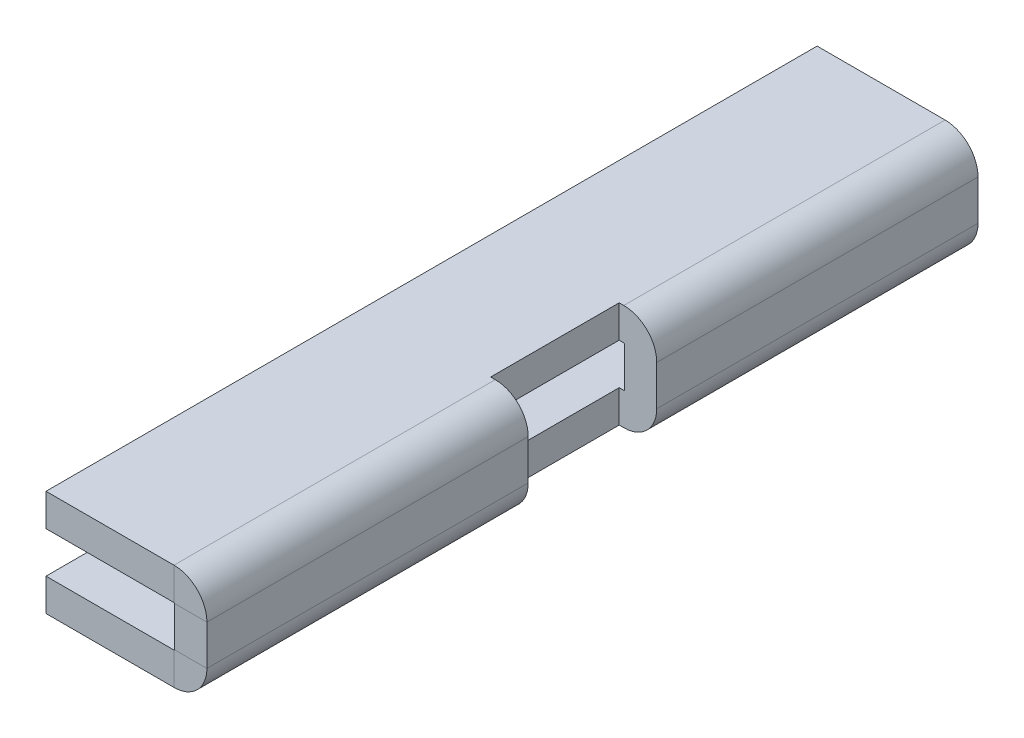
ISO-10303-21;
HEADER;
FILE_DESCRIPTION(('STEP AP214'),'2;1');
FILE_NAME('part.step','',(''),(''),'','','');
FILE_SCHEMA(('AUTOMOTIVE_DESIGN { 1 0 10303 214 1 1 1 1 }'));
ENDSEC;
DATA;
#1=APPLICATION_CONTEXT('core data for automotive mechanical design processes');
#2=APPLICATION_PROTOCOL_DEFINITION('international standard','automotive_design',2000,#1);
#3=PRODUCT_CONTEXT('',#1,'mechanical');
#4=PRODUCT('Part','Part','',(#3));
#5=PRODUCT_RELATED_PRODUCT_CATEGORY('part','',(#4));
#6=PRODUCT_DEFINITION_FORMATION('','',#4);
#7=PRODUCT_DEFINITION_CONTEXT('part definition',#1,'design');
#8=PRODUCT_DEFINITION('design','',#6,#7);
#9=PRODUCT_DEFINITION_SHAPE('','',#8);
#10=(LENGTH_UNIT() NAMED_UNIT(*) SI_UNIT(.MILLI.,.METRE.));
#11=(NAMED_UNIT(*) PLANE_ANGLE_UNIT() SI_UNIT($,.RADIAN.));
#12=(NAMED_UNIT(*) SI_UNIT($,.STERADIAN.) SOLID_ANGLE_UNIT());
#13=UNCERTAINTY_MEASURE_WITH_UNIT(LENGTH_MEASURE(1.E-05),#10,'distance_accuracy_value','');
#14=(GEOMETRIC_REPRESENTATION_CONTEXT(3) GLOBAL_UNCERTAINTY_ASSIGNED_CONTEXT((#13)) GLOBAL_UNIT_ASSIGNED_CONTEXT((#10,
#11,#12)) REPRESENTATION_CONTEXT('',''));
#15=CARTESIAN_POINT('',(0.,0.,0.));
#16=DIRECTION('',(0.,0.,1.));
#17=DIRECTION('',(1.,0.,0.));
#18=AXIS2_PLACEMENT_3D('',#15,#16,#17);
#19=CARTESIAN_POINT('',(0.,1.016,-19.05));
#20=DIRECTION('',(1.,0.,0.));
#21=DIRECTION('',(0.,1.,0.));
#22=AXIS2_PLACEMENT_3D('',#19,#20,#21);
#23=PLANE('',#22);
#24=DIRECTION('',(0.,1.,0.));
#25=VECTOR('',#24,1.);
#26=CARTESIAN_POINT('',(0.,1.016,3.175));
#27=LINE('',#26,#25);
#28=CARTESIAN_POINT('',(0.,-0.990599999999999,3.175));
#29=VERTEX_POINT('',#28);
#30=CARTESIAN_POINT('',(0.,0.9906,3.175));
#31=VERTEX_POINT('',#30);
#32=EDGE_CURVE('E53',#29,#31,#27,.T.);
#33=ORIENTED_EDGE('',*,*,#32,.F.);
#34=DIRECTION('',(0.,0.,1.));
#35=VECTOR('',#34,1.);
#36=CARTESIAN_POINT('',(0.,-0.990599999999999,19.05));
#37=LINE('',#36,#35);
#38=CARTESIAN_POINT('',(0.,-0.990599999999999,19.05));
#39=VERTEX_POINT('',#38);
#40=EDGE_CURVE('E286',#29,#39,#37,.T.);
#41=ORIENTED_EDGE('',*,*,#40,.T.);
#42=DIRECTION('',(0.,1.,0.));
#43=VECTOR('',#42,1.);
#44=CARTESIAN_POINT('',(0.,1.016,19.05));
#45=LINE('',#44,#43);
#46=CARTESIAN_POINT('',(0.,0.9906,19.05));
#47=VERTEX_POINT('',#46);
#48=EDGE_CURVE('E271',#39,#47,#45,.T.);
#49=ORIENTED_EDGE('',*,*,#48,.T.);
#50=DIRECTION('',(0.,0.,1.));
#51=VECTOR('',#50,1.);
#52=CARTESIAN_POINT('',(0.,0.9906,-19.05));
#53=LINE('',#52,#51);
#54=EDGE_CURVE('E305',#47,#31,#53,.F.);
#55=ORIENTED_EDGE('',*,*,#54,.T.);
#56=EDGE_LOOP('',(#33,#41,#49,#55));
#57=FACE_BOUND('',#56,.T.);
#58=ADVANCED_FACE('F38',(#57),#23,.F.);
#59=CARTESIAN_POINT('',(-0.0254000000000003,-0.990599999999999,-19.05));
#60=DIRECTION('',(0.,0.,-1.));
#61=DIRECTION('',(-1.,0.,0.));
#62=AXIS2_PLACEMENT_3D('',#59,#60,#61);
#63=CYLINDRICAL_SURFACE('',#62,0.0254000000000001);
#64=CARTESIAN_POINT('',(-0.0254000000000003,-0.990599999999999,3.175));
#65=DIRECTION('',(0.,0.,-1.));
#66=DIRECTION('',(-1.,0.,0.));
#67=AXIS2_PLACEMENT_3D('',#64,#65,#66);
#68=CIRCLE('',#67,0.0254000000000001);
#69=CARTESIAN_POINT('',(-0.0254000000000003,-1.016,3.175));
#70=VERTEX_POINT('',#69);
#71=EDGE_CURVE('E236',#70,#29,#68,.F.);
#72=ORIENTED_EDGE('',*,*,#71,.F.);
#73=DIRECTION('',(0.,0.,1.));
#74=VECTOR('',#73,1.);
#75=CARTESIAN_POINT('',(-0.0254000000000003,-1.016,-19.05));
#76=LINE('',#75,#74);
#77=CARTESIAN_POINT('',(-0.0254000000000003,-1.016,19.05));
#78=VERTEX_POINT('',#77);
#79=EDGE_CURVE('E291',#78,#70,#76,.F.);
#80=ORIENTED_EDGE('',*,*,#79,.F.);
#81=CARTESIAN_POINT('',(-0.0254000000000003,-0.990599999999999,19.05));
#82=DIRECTION('',(0.,0.,-1.));
#83=DIRECTION('',(-1.,0.,0.));
#84=AXIS2_PLACEMENT_3D('',#81,#82,#83);
#85=CIRCLE('',#84,0.0254000000000001);
#86=EDGE_CURVE('E295',#78,#39,#85,.F.);
#87=ORIENTED_EDGE('',*,*,#86,.T.);
#88=ORIENTED_EDGE('',*,*,#40,.F.);
#89=EDGE_LOOP('',(#72,#80,#87,#88));
#90=FACE_BOUND('',#89,.T.);
#91=ADVANCED_FACE('F477',(#90),#63,.F.);
#92=CARTESIAN_POINT('',(-0.0254000000000001,0.9906,-19.05));
#93=DIRECTION('',(0.,0.,-1.));
#94=DIRECTION('',(-1.,0.,0.));
#95=AXIS2_PLACEMENT_3D('',#92,#93,#94);
#96=CYLINDRICAL_SURFACE('',#95,0.0254000000000001);
#97=CARTESIAN_POINT('',(-0.0254000000000001,0.9906,3.175));
#98=DIRECTION('',(0.,0.,-1.));
#99=DIRECTION('',(-1.,0.,0.));
#100=AXIS2_PLACEMENT_3D('',#97,#98,#99);
#101=CIRCLE('',#100,0.0254000000000001);
#102=CARTESIAN_POINT('',(-0.0254000000000001,1.016,3.175));
#103=VERTEX_POINT('',#102);
#104=EDGE_CURVE('E231',#31,#103,#101,.F.);
#105=ORIENTED_EDGE('',*,*,#104,.F.);
#106=ORIENTED_EDGE('',*,*,#54,.F.);
#107=CARTESIAN_POINT('',(-0.0254000000000001,0.9906,19.05));
#108=DIRECTION('',(0.,0.,-1.));
#109=DIRECTION('',(-1.,0.,0.));
#110=AXIS2_PLACEMENT_3D('',#107,#108,#109);
#111=CIRCLE('',#110,0.0254000000000001);
#112=CARTESIAN_POINT('',(-0.0254000000000001,1.016,19.05));
#113=VERTEX_POINT('',#112);
#114=EDGE_CURVE('E309',#47,#113,#111,.F.);
#115=ORIENTED_EDGE('',*,*,#114,.T.);
#116=DIRECTION('',(0.,0.,1.));
#117=VECTOR('',#116,1.);
#118=CARTESIAN_POINT('',(-0.0254000000000001,1.016,19.05));
#119=LINE('',#118,#117);
#120=EDGE_CURVE('E294',#103,#113,#119,.T.);
#121=ORIENTED_EDGE('',*,*,#120,.F.);
#122=EDGE_LOOP('',(#105,#106,#115,#121));
#123=FACE_BOUND('',#122,.T.);
#124=ADVANCED_FACE('F471',(#123),#96,.F.);
#125=CARTESIAN_POINT('',(1.6002,1.016,-19.05));
#126=DIRECTION('',(1.,0.,0.));
#127=DIRECTION('',(0.,1.,0.));
#128=AXIS2_PLACEMENT_3D('',#125,#126,#127);
#129=PLANE('',#128);
#130=DIRECTION('',(0.,0.,1.));
#131=VECTOR('',#130,1.);
#132=CARTESIAN_POINT('',(1.6002,-0.9906,-19.05));
#133=LINE('',#132,#131);
#134=CARTESIAN_POINT('',(1.6002,-0.990599999999999,3.175));
#135=VERTEX_POINT('',#134);
#136=CARTESIAN_POINT('',(1.6002,-0.990599999999999,19.05));
#137=VERTEX_POINT('',#136);
#138=EDGE_CURVE('E323',#135,#137,#133,.T.);
#139=ORIENTED_EDGE('',*,*,#138,.F.);
#140=DIRECTION('',(0.,1.,0.));
#141=VECTOR('',#140,1.);
#142=CARTESIAN_POINT('',(1.6002,2.6162,3.175));
#143=LINE('',#142,#141);
#144=CARTESIAN_POINT('',(1.6002,0.9906,3.175));
#145=VERTEX_POINT('',#144);
#146=EDGE_CURVE('E499',#135,#145,#143,.T.);
#147=ORIENTED_EDGE('',*,*,#146,.T.);
#148=DIRECTION('',(0.,0.,1.));
#149=VECTOR('',#148,1.);
#150=CARTESIAN_POINT('',(1.6002,0.9906,-19.05));
#151=LINE('',#150,#149);
#152=CARTESIAN_POINT('',(1.6002,0.9906,19.05));
#153=VERTEX_POINT('',#152);
#154=EDGE_CURVE('E312',#153,#145,#151,.F.);
#155=ORIENTED_EDGE('',*,*,#154,.F.);
#156=DIRECTION('',(0.,1.,0.));
#157=VECTOR('',#156,1.);
#158=CARTESIAN_POINT('',(1.6002,1.016,19.05));
#159=LINE('',#158,#157);
#160=EDGE_CURVE('E346',#137,#153,#159,.T.);
#161=ORIENTED_EDGE('',*,*,#160,.F.);
#162=EDGE_LOOP('',(#139,#147,#155,#161));
#163=FACE_BOUND('',#162,.T.);
#164=ADVANCED_FACE('F409',(#163),#129,.T.);
#165=CARTESIAN_POINT('',(-0.0254000000000003,-0.990599999999999,-19.05));
#166=DIRECTION('',(0.,0.,-1.));
#167=DIRECTION('',(-1.,0.,0.));
#168=AXIS2_PLACEMENT_3D('',#165,#166,#167);
#169=CYLINDRICAL_SURFACE('',#168,1.6256);
#170=DIRECTION('',(0.,0.,1.));
#171=VECTOR('',#170,1.);
#172=CARTESIAN_POINT('',(-0.0254000000000005,-2.6162,-19.05));
#173=LINE('',#172,#171);
#174=CARTESIAN_POINT('',(-0.0254000000000005,-2.6162,19.05));
#175=VERTEX_POINT('',#174);
#176=CARTESIAN_POINT('',(-0.0253999999999999,-2.6162,3.175));
#177=VERTEX_POINT('',#176);
#178=EDGE_CURVE('E315',#175,#177,#173,.F.);
#179=ORIENTED_EDGE('',*,*,#178,.T.);
#180=CARTESIAN_POINT('',(-0.0254000000000003,-0.990599999999999,3.175));
#181=DIRECTION('',(0.,0.,-1.));
#182=DIRECTION('',(-1.,0.,0.));
#183=AXIS2_PLACEMENT_3D('',#180,#181,#182);
#184=CIRCLE('',#183,1.6256);
#185=EDGE_CURVE('E224',#177,#135,#184,.F.);
#186=ORIENTED_EDGE('',*,*,#185,.T.);
#187=ORIENTED_EDGE('',*,*,#138,.T.);
#188=CARTESIAN_POINT('',(-0.0254000000000003,-0.990599999999999,19.05));
#189=DIRECTION('',(0.,0.,-1.));
#190=DIRECTION('',(-1.,0.,0.));
#191=AXIS2_PLACEMENT_3D('',#188,#189,#190);
#192=CIRCLE('',#191,1.6256);
#193=EDGE_CURVE('E343',#175,#137,#192,.F.);
#194=ORIENTED_EDGE('',*,*,#193,.F.);
#195=EDGE_LOOP('',(#179,#186,#187,#194));
#196=FACE_BOUND('',#195,.T.);
#197=ADVANCED_FACE('F415',(#196),#169,.T.);
#198=CARTESIAN_POINT('',(-0.0254000000000001,0.9906,-19.05));
#199=DIRECTION('',(0.,0.,-1.));
#200=DIRECTION('',(-1.,0.,0.));
#201=AXIS2_PLACEMENT_3D('',#198,#199,#200);
#202=CYLINDRICAL_SURFACE('',#201,1.6256);
#203=ORIENTED_EDGE('',*,*,#154,.T.);
#204=CARTESIAN_POINT('',(-0.0254000000000001,0.9906,3.175));
#205=DIRECTION('',(0.,0.,-1.));
#206=DIRECTION('',(-1.,0.,0.));
#207=AXIS2_PLACEMENT_3D('',#204,#205,#206);
#208=CIRCLE('',#207,1.6256);
#209=CARTESIAN_POINT('',(-0.0254000000000001,2.6162,3.17499999999999));
#210=VERTEX_POINT('',#209);
#211=EDGE_CURVE('E46',#145,#210,#208,.F.);
#212=ORIENTED_EDGE('',*,*,#211,.T.);
#213=DIRECTION('',(0.,0.,1.));
#214=VECTOR('',#213,1.);
#215=CARTESIAN_POINT('',(-0.0254000000000001,2.6162,-19.05));
#216=LINE('',#215,#214);
#217=CARTESIAN_POINT('',(-0.0254000000000002,2.6162,19.05));
#218=VERTEX_POINT('',#217);
#219=EDGE_CURVE('E318',#210,#218,#216,.T.);
#220=ORIENTED_EDGE('',*,*,#219,.T.);
#221=CARTESIAN_POINT('',(-0.0254000000000001,0.9906,19.05));
#222=DIRECTION('',(0.,0.,-1.));
#223=DIRECTION('',(-1.,0.,0.));
#224=AXIS2_PLACEMENT_3D('',#221,#222,#223);
#225=CIRCLE('',#224,1.6256);
#226=EDGE_CURVE('E260',#153,#218,#225,.F.);
#227=ORIENTED_EDGE('',*,*,#226,.F.);
#228=EDGE_LOOP('',(#203,#212,#220,#227));
#229=FACE_BOUND('',#228,.T.);
#230=ADVANCED_FACE('F391',(#229),#202,.T.);
#231=CARTESIAN_POINT('',(0.,1.016,19.05));
#232=DIRECTION('',(0.,0.,-1.));
#233=DIRECTION('',(0.,1.,0.));
#234=AXIS2_PLACEMENT_3D('',#231,#232,#233);
#235=PLANE('',#234);
#236=DIRECTION('',(-1.,0.,0.));
#237=VECTOR('',#236,1.);
#238=CARTESIAN_POINT('',(0.,-0.990599999999999,19.05));
#239=LINE('',#238,#237);
#240=EDGE_CURVE('E387',#137,#39,#239,.T.);
#241=ORIENTED_EDGE('',*,*,#240,.F.);
#242=ORIENTED_EDGE('',*,*,#160,.T.);
#243=DIRECTION('',(-1.,0.,0.));
#244=VECTOR('',#243,1.);
#245=CARTESIAN_POINT('',(0.,0.9906,19.05));
#246=LINE('',#245,#244);
#247=EDGE_CURVE('E385',#153,#47,#246,.T.);
#248=ORIENTED_EDGE('',*,*,#247,.T.);
#249=ORIENTED_EDGE('',*,*,#48,.F.);
#250=EDGE_LOOP('',(#241,#242,#248,#249));
#251=FACE_BOUND('',#250,.T.);
#252=ADVANCED_FACE('F405',(#251),#235,.F.);
#253=CARTESIAN_POINT('',(-0.0254000000000001,0.9906,19.05));
#254=DIRECTION('',(0.,0.,1.));
#255=DIRECTION('',(1.,0.,0.));
#256=AXIS2_PLACEMENT_3D('',#253,#254,#255);
#257=PLANE('',#256);
#258=ORIENTED_EDGE('',*,*,#247,.F.);
#259=ORIENTED_EDGE('',*,*,#226,.T.);
#260=DIRECTION('',(0.,-1.,0.));
#261=VECTOR('',#260,1.);
#262=CARTESIAN_POINT('',(-0.0254000000000001,1.016,19.05));
#263=LINE('',#262,#261);
#264=EDGE_CURVE('E382',#218,#113,#263,.T.);
#265=ORIENTED_EDGE('',*,*,#264,.T.);
#266=ORIENTED_EDGE('',*,*,#114,.F.);
#267=EDGE_LOOP('',(#258,#259,#265,#266));
#268=FACE_BOUND('',#267,.T.);
#269=ADVANCED_FACE('F400',(#268),#257,.T.);
#270=CARTESIAN_POINT('',(-6.35,1.016,19.05));
#271=DIRECTION('',(0.,0.,-1.));
#272=DIRECTION('',(-1.,0.,0.));
#273=AXIS2_PLACEMENT_3D('',#270,#271,#272);
#274=PLANE('',#273);
#275=ORIENTED_EDGE('',*,*,#264,.F.);
#276=DIRECTION('',(-1.,0.,0.));
#277=VECTOR('',#276,1.);
#278=CARTESIAN_POINT('',(-6.35,2.6162,19.05));
#279=LINE('',#278,#277);
#280=CARTESIAN_POINT('',(-6.35,2.6162,19.05));
#281=VERTEX_POINT('',#280);
#282=EDGE_CURVE('E342',#218,#281,#279,.T.);
#283=ORIENTED_EDGE('',*,*,#282,.T.);
#284=DIRECTION('',(0.,-1.,0.));
#285=VECTOR('',#284,1.);
#286=CARTESIAN_POINT('',(-6.35,1.016,19.05));
#287=LINE('',#286,#285);
#288=CARTESIAN_POINT('',(-6.35,1.016,19.05));
#289=VERTEX_POINT('',#288);
#290=EDGE_CURVE('E380',#281,#289,#287,.T.);
#291=ORIENTED_EDGE('',*,*,#290,.T.);
#292=DIRECTION('',(-1.,0.,0.));
#293=VECTOR('',#292,1.);
#294=CARTESIAN_POINT('',(-6.35,1.016,19.05));
#295=LINE('',#294,#293);
#296=EDGE_CURVE('E261',#113,#289,#295,.T.);
#297=ORIENTED_EDGE('',*,*,#296,.F.);
#298=EDGE_LOOP('',(#275,#283,#291,#297));
#299=FACE_BOUND('',#298,.T.);
#300=ADVANCED_FACE('F465',(#299),#274,.F.);
#301=CARTESIAN_POINT('',(-6.35,1.016,-19.05));
#302=DIRECTION('',(-1.,0.,0.));
#303=DIRECTION('',(0.,0.,1.));
#304=AXIS2_PLACEMENT_3D('',#301,#302,#303);
#305=PLANE('',#304);
#306=ORIENTED_EDGE('',*,*,#290,.F.);
#307=DIRECTION('',(0.,0.,1.));
#308=VECTOR('',#307,1.);
#309=CARTESIAN_POINT('',(-6.35,2.6162,-19.05));
#310=LINE('',#309,#308);
#311=CARTESIAN_POINT('',(-6.35,2.6162,-19.05));
#312=VERTEX_POINT('',#311);
#313=EDGE_CURVE('E353',#312,#281,#310,.T.);
#314=ORIENTED_EDGE('',*,*,#313,.F.);
#315=DIRECTION('',(0.,-1.,0.));
#316=VECTOR('',#315,1.);
#317=CARTESIAN_POINT('',(-6.35,1.016,-19.05));
#318=LINE('',#317,#316);
#319=CARTESIAN_POINT('',(-6.35,1.016,-19.05));
#320=VERTEX_POINT('',#319);
#321=EDGE_CURVE('E378',#312,#320,#318,.T.);
#322=ORIENTED_EDGE('',*,*,#321,.T.);
#323=DIRECTION('',(0.,0.,1.));
#324=VECTOR('',#323,1.);
#325=CARTESIAN_POINT('',(-6.35,1.016,-19.05));
#326=LINE('',#325,#324);
#327=EDGE_CURVE('E264',#320,#289,#326,.T.);
#328=ORIENTED_EDGE('',*,*,#327,.T.);
#329=EDGE_LOOP('',(#306,#314,#322,#328));
#330=FACE_BOUND('',#329,.T.);
#331=ADVANCED_FACE('F462',(#330),#305,.T.);
#332=CARTESIAN_POINT('',(-6.35,1.016,-19.05));
#333=DIRECTION('',(0.,0.,-1.));
#334=DIRECTION('',(-1.,0.,0.));
#335=AXIS2_PLACEMENT_3D('',#332,#333,#334);
#336=PLANE('',#335);
#337=ORIENTED_EDGE('',*,*,#321,.F.);
#338=DIRECTION('',(-1.,0.,0.));
#339=VECTOR('',#338,1.);
#340=CARTESIAN_POINT('',(-6.35,2.6162,-19.05));
#341=LINE('',#340,#339);
#342=CARTESIAN_POINT('',(-0.0254000000000001,2.6162,-19.05));
#343=VERTEX_POINT('',#342);
#344=EDGE_CURVE('E350',#343,#312,#341,.T.);
#345=ORIENTED_EDGE('',*,*,#344,.F.);
#346=DIRECTION('',(0.,-1.,0.));
#347=VECTOR('',#346,1.);
#348=CARTESIAN_POINT('',(-0.0254000000000001,1.016,-19.05));
#349=LINE('',#348,#347);
#350=CARTESIAN_POINT('',(-0.0254000000000001,1.016,-19.05));
#351=VERTEX_POINT('',#350);
#352=EDGE_CURVE('E376',#343,#351,#349,.T.);
#353=ORIENTED_EDGE('',*,*,#352,.T.);
#354=DIRECTION('',(-1.,0.,0.));
#355=VECTOR('',#354,1.);
#356=CARTESIAN_POINT('',(-6.35,1.016,-19.05));
#357=LINE('',#356,#355);
#358=EDGE_CURVE('E268',#351,#320,#357,.T.);
#359=ORIENTED_EDGE('',*,*,#358,.T.);
#360=EDGE_LOOP('',(#337,#345,#353,#359));
#361=FACE_BOUND('',#360,.T.);
#362=ADVANCED_FACE('F459',(#361),#336,.T.);
#363=CARTESIAN_POINT('',(-0.0254000000000001,0.9906,-19.05));
#364=DIRECTION('',(0.,0.,-1.));
#365=DIRECTION('',(-1.,0.,0.));
#366=AXIS2_PLACEMENT_3D('',#363,#364,#365);
#367=PLANE('',#366);
#368=ORIENTED_EDGE('',*,*,#352,.F.);
#369=CARTESIAN_POINT('',(-0.0254000000000001,0.9906,-19.05));
#370=DIRECTION('',(0.,0.,-1.));
#371=DIRECTION('',(-1.,0.,0.));
#372=AXIS2_PLACEMENT_3D('',#369,#370,#371);
#373=CIRCLE('',#372,1.6256);
#374=CARTESIAN_POINT('',(1.6002,0.9906,-19.05));
#375=VERTEX_POINT('',#374);
#376=EDGE_CURVE('E347',#343,#375,#373,.T.);
#377=ORIENTED_EDGE('',*,*,#376,.T.);
#378=DIRECTION('',(-1.,0.,0.));
#379=VECTOR('',#378,1.);
#380=CARTESIAN_POINT('',(0.,0.9906,-19.05));
#381=LINE('',#380,#379);
#382=CARTESIAN_POINT('',(0.,0.9906,-19.05));
#383=VERTEX_POINT('',#382);
#384=EDGE_CURVE('E373',#375,#383,#381,.T.);
#385=ORIENTED_EDGE('',*,*,#384,.T.);
#386=CARTESIAN_POINT('',(-0.0254000000000001,0.9906,-19.05));
#387=DIRECTION('',(0.,0.,1.));
#388=DIRECTION('',(1.,0.,0.));
#389=AXIS2_PLACEMENT_3D('',#386,#387,#388);
#390=CIRCLE('',#389,0.0254000000000001);
#391=EDGE_CURVE('E298',#351,#383,#390,.F.);
#392=ORIENTED_EDGE('',*,*,#391,.F.);
#393=EDGE_LOOP('',(#368,#377,#385,#392));
#394=FACE_BOUND('',#393,.T.);
#395=ADVANCED_FACE('F453',(#394),#367,.T.);
#396=CARTESIAN_POINT('',(0.,1.016,-19.05));
#397=DIRECTION('',(0.,0.,-1.));
#398=DIRECTION('',(0.,1.,0.));
#399=AXIS2_PLACEMENT_3D('',#396,#397,#398);
#400=PLANE('',#399);
#401=ORIENTED_EDGE('',*,*,#384,.F.);
#402=DIRECTION('',(0.,1.,0.));
#403=VECTOR('',#402,1.);
#404=CARTESIAN_POINT('',(1.6002,1.016,-19.05));
#405=LINE('',#404,#403);
#406=CARTESIAN_POINT('',(1.6002,-0.9906,-19.05));
#407=VERTEX_POINT('',#406);
#408=EDGE_CURVE('E333',#407,#375,#405,.T.);
#409=ORIENTED_EDGE('',*,*,#408,.F.);
#410=DIRECTION('',(-1.,0.,0.));
#411=VECTOR('',#410,1.);
#412=CARTESIAN_POINT('',(0.,-0.990599999999999,-19.05));
#413=LINE('',#412,#411);
#414=CARTESIAN_POINT('',(0.,-0.990599999999999,-19.05));
#415=VERTEX_POINT('',#414);
#416=EDGE_CURVE('E371',#407,#415,#413,.T.);
#417=ORIENTED_EDGE('',*,*,#416,.T.);
#418=DIRECTION('',(0.,1.,0.));
#419=VECTOR('',#418,1.);
#420=CARTESIAN_POINT('',(0.,1.016,-19.05));
#421=LINE('',#420,#419);
#422=EDGE_CURVE('E274',#415,#383,#421,.T.);
#423=ORIENTED_EDGE('',*,*,#422,.T.);
#424=EDGE_LOOP('',(#401,#409,#417,#423));
#425=FACE_BOUND('',#424,.T.);
#426=ADVANCED_FACE('F445',(#425),#400,.T.);
#427=CARTESIAN_POINT('',(-0.0254000000000003,-0.990599999999999,-19.05));
#428=DIRECTION('',(0.,0.,-1.));
#429=DIRECTION('',(-1.,0.,0.));
#430=AXIS2_PLACEMENT_3D('',#427,#428,#429);
#431=PLANE('',#430);
#432=ORIENTED_EDGE('',*,*,#416,.F.);
#433=CARTESIAN_POINT('',(-0.0254000000000003,-0.990599999999999,-19.05));
#434=DIRECTION('',(0.,0.,-1.));
#435=DIRECTION('',(-1.,0.,0.));
#436=AXIS2_PLACEMENT_3D('',#433,#434,#435);
#437=CIRCLE('',#436,1.6256);
#438=CARTESIAN_POINT('',(-0.0254,-2.6162,-19.05));
#439=VERTEX_POINT('',#438);
#440=EDGE_CURVE('E339',#407,#439,#437,.T.);
#441=ORIENTED_EDGE('',*,*,#440,.T.);
#442=DIRECTION('',(0.,1.,0.));
#443=VECTOR('',#442,1.);
#444=CARTESIAN_POINT('',(-0.0254000000000003,-1.016,-19.05));
#445=LINE('',#444,#443);
#446=CARTESIAN_POINT('',(-0.0254000000000003,-1.016,-19.05));
#447=VERTEX_POINT('',#446);
#448=EDGE_CURVE('E368',#439,#447,#445,.T.);
#449=ORIENTED_EDGE('',*,*,#448,.T.);
#450=CARTESIAN_POINT('',(-0.0254000000000003,-0.990599999999999,-19.05));
#451=DIRECTION('',(0.,0.,1.));
#452=DIRECTION('',(1.,0.,0.));
#453=AXIS2_PLACEMENT_3D('',#450,#451,#452);
#454=CIRCLE('',#453,0.0254000000000001);
#455=EDGE_CURVE('E265',#415,#447,#454,.F.);
#456=ORIENTED_EDGE('',*,*,#455,.F.);
#457=EDGE_LOOP('',(#432,#441,#449,#456));
#458=FACE_BOUND('',#457,.T.);
#459=ADVANCED_FACE('F436',(#458),#431,.T.);
#460=CARTESIAN_POINT('',(0.,-1.016,-19.05));
#461=DIRECTION('',(0.,0.,-1.));
#462=DIRECTION('',(1.,0.,0.));
#463=AXIS2_PLACEMENT_3D('',#460,#461,#462);
#464=PLANE('',#463);
#465=ORIENTED_EDGE('',*,*,#448,.F.);
#466=DIRECTION('',(1.,0.,0.));
#467=VECTOR('',#466,1.);
#468=CARTESIAN_POINT('',(0.,-2.6162,-19.05));
#469=LINE('',#468,#467);
#470=CARTESIAN_POINT('',(-6.35,-2.6162,-19.05));
#471=VERTEX_POINT('',#470);
#472=EDGE_CURVE('E332',#471,#439,#469,.T.);
#473=ORIENTED_EDGE('',*,*,#472,.F.);
#474=DIRECTION('',(0.,1.,0.));
#475=VECTOR('',#474,1.);
#476=CARTESIAN_POINT('',(-6.35,-1.016,-19.05));
#477=LINE('',#476,#475);
#478=CARTESIAN_POINT('',(-6.35,-1.016,-19.05));
#479=VERTEX_POINT('',#478);
#480=EDGE_CURVE('E366',#471,#479,#477,.T.);
#481=ORIENTED_EDGE('',*,*,#480,.T.);
#482=DIRECTION('',(1.,0.,0.));
#483=VECTOR('',#482,1.);
#484=CARTESIAN_POINT('',(0.,-1.016,-19.05));
#485=LINE('',#484,#483);
#486=EDGE_CURVE('E280',#479,#447,#485,.T.);
#487=ORIENTED_EDGE('',*,*,#486,.T.);
#488=EDGE_LOOP('',(#465,#473,#481,#487));
#489=FACE_BOUND('',#488,.T.);
#490=ADVANCED_FACE('F432',(#489),#464,.T.);
#491=CARTESIAN_POINT('',(-6.35,-1.016,-19.05));
#492=DIRECTION('',(1.,0.,0.));
#493=DIRECTION('',(0.,0.,1.));
#494=AXIS2_PLACEMENT_3D('',#491,#492,#493);
#495=PLANE('',#494);
#496=ORIENTED_EDGE('',*,*,#480,.F.);
#497=DIRECTION('',(0.,0.,1.));
#498=VECTOR('',#497,1.);
#499=CARTESIAN_POINT('',(-6.35,-2.6162,-19.05));
#500=LINE('',#499,#498);
#501=CARTESIAN_POINT('',(-6.35,-2.6162,19.05));
#502=VERTEX_POINT('',#501);
#503=EDGE_CURVE('E334',#471,#502,#500,.T.);
#504=ORIENTED_EDGE('',*,*,#503,.T.);
#505=DIRECTION('',(0.,1.,0.));
#506=VECTOR('',#505,1.);
#507=CARTESIAN_POINT('',(-6.35,-1.016,19.05));
#508=LINE('',#507,#506);
#509=CARTESIAN_POINT('',(-6.35,-1.016,19.05));
#510=VERTEX_POINT('',#509);
#511=EDGE_CURVE('E364',#502,#510,#508,.T.);
#512=ORIENTED_EDGE('',*,*,#511,.T.);
#513=DIRECTION('',(0.,0.,1.));
#514=VECTOR('',#513,1.);
#515=CARTESIAN_POINT('',(-6.35,-1.016,-19.05));
#516=LINE('',#515,#514);
#517=EDGE_CURVE('E283',#479,#510,#516,.T.);
#518=ORIENTED_EDGE('',*,*,#517,.F.);
#519=EDGE_LOOP('',(#496,#504,#512,#518));
#520=FACE_BOUND('',#519,.T.);
#521=ADVANCED_FACE('F426',(#520),#495,.F.);
#522=CARTESIAN_POINT('',(0.,-1.016,19.05));
#523=DIRECTION('',(0.,0.,-1.));
#524=DIRECTION('',(1.,0.,0.));
#525=AXIS2_PLACEMENT_3D('',#522,#523,#524);
#526=PLANE('',#525);
#527=ORIENTED_EDGE('',*,*,#511,.F.);
#528=DIRECTION('',(1.,0.,0.));
#529=VECTOR('',#528,1.);
#530=CARTESIAN_POINT('',(0.,-2.6162,19.05));
#531=LINE('',#530,#529);
#532=EDGE_CURVE('E329',#502,#175,#531,.T.);
#533=ORIENTED_EDGE('',*,*,#532,.T.);
#534=DIRECTION('',(0.,1.,0.));
#535=VECTOR('',#534,1.);
#536=CARTESIAN_POINT('',(-0.0254000000000003,-1.016,19.05));
#537=LINE('',#536,#535);
#538=EDGE_CURVE('E308',#175,#78,#537,.T.);
#539=ORIENTED_EDGE('',*,*,#538,.T.);
#540=DIRECTION('',(1.,0.,0.));
#541=VECTOR('',#540,1.);
#542=CARTESIAN_POINT('',(0.,-1.016,19.05));
#543=LINE('',#542,#541);
#544=EDGE_CURVE('E277',#510,#78,#543,.T.);
#545=ORIENTED_EDGE('',*,*,#544,.F.);
#546=EDGE_LOOP('',(#527,#533,#539,#545));
#547=FACE_BOUND('',#546,.T.);
#548=ADVANCED_FACE('F418',(#547),#526,.F.);
#549=CARTESIAN_POINT('',(-0.0254000000000003,-0.990599999999999,19.05));
#550=DIRECTION('',(0.,0.,1.));
#551=DIRECTION('',(1.,0.,0.));
#552=AXIS2_PLACEMENT_3D('',#549,#550,#551);
#553=PLANE('',#552);
#554=ORIENTED_EDGE('',*,*,#193,.T.);
#555=ORIENTED_EDGE('',*,*,#240,.T.);
#556=ORIENTED_EDGE('',*,*,#86,.F.);
#557=ORIENTED_EDGE('',*,*,#538,.F.);
#558=EDGE_LOOP('',(#554,#555,#556,#557));
#559=FACE_BOUND('',#558,.T.);
#560=ADVANCED_FACE('F40',(#559),#553,.T.);
#561=CARTESIAN_POINT('',(0.,-1.016,-19.05));
#562=DIRECTION('',(0.,-1.,0.));
#563=DIRECTION('',(1.,0.,0.));
#564=AXIS2_PLACEMENT_3D('',#561,#562,#563);
#565=PLANE('',#564);
#566=DIRECTION('',(0.,0.,-1.));
#567=VECTOR('',#566,1.);
#568=CARTESIAN_POINT('',(-0.254,-1.016,-19.05));
#569=LINE('',#568,#567);
#570=CARTESIAN_POINT('',(-0.254,-1.016,3.175));
#571=VERTEX_POINT('',#570);
#572=CARTESIAN_POINT('',(-0.254,-1.016,-3.175));
#573=VERTEX_POINT('',#572);
#574=EDGE_CURVE('E257',#571,#573,#569,.T.);
#575=ORIENTED_EDGE('',*,*,#574,.T.);
#576=DIRECTION('',(1.,0.,0.));
#577=VECTOR('',#576,1.);
#578=CARTESIAN_POINT('',(0.,-1.016,-3.175));
#579=LINE('',#578,#577);
#580=CARTESIAN_POINT('',(-0.0254000000000003,-1.016,-3.175));
#581=VERTEX_POINT('',#580);
#582=EDGE_CURVE('E253',#573,#581,#579,.T.);
#583=ORIENTED_EDGE('',*,*,#582,.T.);
#584=EDGE_CURVE('E290',#581,#447,#76,.F.);
#585=ORIENTED_EDGE('',*,*,#584,.T.);
#586=ORIENTED_EDGE('',*,*,#486,.F.);
#587=ORIENTED_EDGE('',*,*,#517,.T.);
#588=ORIENTED_EDGE('',*,*,#544,.T.);
#589=ORIENTED_EDGE('',*,*,#79,.T.);
#590=DIRECTION('',(1.,0.,0.));
#591=VECTOR('',#590,1.);
#592=CARTESIAN_POINT('',(0.,-1.016,3.175));
#593=LINE('',#592,#591);
#594=EDGE_CURVE('E238',#571,#70,#593,.T.);
#595=ORIENTED_EDGE('',*,*,#594,.F.);
#596=EDGE_LOOP('',(#575,#583,#585,#586,#587,#588,#589,#595));
#597=FACE_BOUND('',#596,.T.);
#598=ADVANCED_FACE('F481',(#597),#565,.F.);
#599=CARTESIAN_POINT('',(0.,-0.990599999999999,-3.175));
#600=VERTEX_POINT('',#599);
#601=EDGE_CURVE('E287',#415,#600,#37,.T.);
#602=ORIENTED_EDGE('',*,*,#601,.T.);
#603=DIRECTION('',(0.,1.,0.));
#604=VECTOR('',#603,1.);
#605=CARTESIAN_POINT('',(0.,1.016,-3.175));
#606=LINE('',#605,#604);
#607=CARTESIAN_POINT('',(0.,0.9906,-3.175));
#608=VERTEX_POINT('',#607);
#609=EDGE_CURVE('E247',#600,#608,#606,.T.);
#610=ORIENTED_EDGE('',*,*,#609,.T.);
#611=EDGE_CURVE('E304',#608,#383,#53,.F.);
#612=ORIENTED_EDGE('',*,*,#611,.T.);
#613=ORIENTED_EDGE('',*,*,#422,.F.);
#614=EDGE_LOOP('',(#602,#610,#612,#613));
#615=FACE_BOUND('',#614,.T.);
#616=ADVANCED_FACE('F487',(#615),#23,.F.);
#617=CARTESIAN_POINT('',(-6.35,1.016,-19.05));
#618=DIRECTION('',(0.,1.,0.));
#619=DIRECTION('',(-1.,0.,0.));
#620=AXIS2_PLACEMENT_3D('',#617,#618,#619);
#621=PLANE('',#620);
#622=CARTESIAN_POINT('',(-0.0254000000000001,1.016,-3.175));
#623=VERTEX_POINT('',#622);
#624=EDGE_CURVE('E301',#351,#623,#119,.T.);
#625=ORIENTED_EDGE('',*,*,#624,.T.);
#626=DIRECTION('',(-1.,0.,0.));
#627=VECTOR('',#626,1.);
#628=CARTESIAN_POINT('',(-6.35,1.016,-3.175));
#629=LINE('',#628,#627);
#630=CARTESIAN_POINT('',(-0.254,1.016,-3.175));
#631=VERTEX_POINT('',#630);
#632=EDGE_CURVE('E245',#623,#631,#629,.T.);
#633=ORIENTED_EDGE('',*,*,#632,.T.);
#634=DIRECTION('',(0.,0.,1.));
#635=VECTOR('',#634,1.);
#636=CARTESIAN_POINT('',(-0.254,1.016,-19.05));
#637=LINE('',#636,#635);
#638=CARTESIAN_POINT('',(-0.254,1.016,3.175));
#639=VERTEX_POINT('',#638);
#640=EDGE_CURVE('E216',#631,#639,#637,.T.);
#641=ORIENTED_EDGE('',*,*,#640,.T.);
#642=DIRECTION('',(-1.,0.,0.));
#643=VECTOR('',#642,1.);
#644=CARTESIAN_POINT('',(-6.35,1.016,3.175));
#645=LINE('',#644,#643);
#646=EDGE_CURVE('E233',#103,#639,#645,.T.);
#647=ORIENTED_EDGE('',*,*,#646,.F.);
#648=ORIENTED_EDGE('',*,*,#120,.T.);
#649=ORIENTED_EDGE('',*,*,#296,.T.);
#650=ORIENTED_EDGE('',*,*,#327,.F.);
#651=ORIENTED_EDGE('',*,*,#358,.F.);
#652=EDGE_LOOP('',(#625,#633,#641,#647,#648,#649,#650,#651));
#653=FACE_BOUND('',#652,.T.);
#654=ADVANCED_FACE('F467',(#653),#621,.F.);
#655=ORIENTED_EDGE('',*,*,#584,.F.);
#656=CARTESIAN_POINT('',(-0.0254000000000003,-0.990599999999999,-3.175));
#657=DIRECTION('',(0.,0.,-1.));
#658=DIRECTION('',(-1.,0.,0.));
#659=AXIS2_PLACEMENT_3D('',#656,#657,#658);
#660=CIRCLE('',#659,0.0254000000000001);
#661=EDGE_CURVE('E250',#581,#600,#660,.F.);
#662=ORIENTED_EDGE('',*,*,#661,.T.);
#663=ORIENTED_EDGE('',*,*,#601,.F.);
#664=ORIENTED_EDGE('',*,*,#455,.T.);
#665=EDGE_LOOP('',(#655,#662,#663,#664));
#666=FACE_BOUND('',#665,.T.);
#667=ADVANCED_FACE('F484',(#666),#63,.F.);
#668=ORIENTED_EDGE('',*,*,#611,.F.);
#669=CARTESIAN_POINT('',(-0.0254000000000001,0.9906,-3.175));
#670=DIRECTION('',(0.,0.,-1.));
#671=DIRECTION('',(-1.,0.,0.));
#672=AXIS2_PLACEMENT_3D('',#669,#670,#671);
#673=CIRCLE('',#672,0.0254000000000001);
#674=EDGE_CURVE('E242',#608,#623,#673,.F.);
#675=ORIENTED_EDGE('',*,*,#674,.T.);
#676=ORIENTED_EDGE('',*,*,#624,.F.);
#677=ORIENTED_EDGE('',*,*,#391,.T.);
#678=EDGE_LOOP('',(#668,#675,#676,#677));
#679=FACE_BOUND('',#678,.T.);
#680=ADVANCED_FACE('F490',(#679),#96,.F.);
#681=CARTESIAN_POINT('',(0.,-2.6162,-19.05));
#682=DIRECTION('',(0.,-1.,0.));
#683=DIRECTION('',(1.,0.,0.));
#684=AXIS2_PLACEMENT_3D('',#681,#682,#683);
#685=PLANE('',#684);
#686=DIRECTION('',(1.,0.,0.));
#687=VECTOR('',#686,1.);
#688=CARTESIAN_POINT('',(1.6002,-2.6162,-3.175));
#689=LINE('',#688,#687);
#690=CARTESIAN_POINT('',(-0.253999999999999,-2.6162,-3.175));
#691=VERTEX_POINT('',#690);
#692=CARTESIAN_POINT('',(-0.0253999999999999,-2.6162,-3.175));
#693=VERTEX_POINT('',#692);
#694=EDGE_CURVE('E217',#691,#693,#689,.T.);
#695=ORIENTED_EDGE('',*,*,#694,.F.);
#696=DIRECTION('',(0.,0.,1.));
#697=VECTOR('',#696,1.);
#698=CARTESIAN_POINT('',(-0.253999999999999,-2.6162,-3.175));
#699=LINE('',#698,#697);
#700=CARTESIAN_POINT('',(-0.253999999999999,-2.6162,3.175));
#701=VERTEX_POINT('',#700);
#702=EDGE_CURVE('E221',#691,#701,#699,.T.);
#703=ORIENTED_EDGE('',*,*,#702,.T.);
#704=DIRECTION('',(1.,0.,0.));
#705=VECTOR('',#704,1.);
#706=CARTESIAN_POINT('',(1.6002,-2.6162,3.175));
#707=LINE('',#706,#705);
#708=EDGE_CURVE('E504',#701,#177,#707,.T.);
#709=ORIENTED_EDGE('',*,*,#708,.T.);
#710=ORIENTED_EDGE('',*,*,#178,.F.);
#711=ORIENTED_EDGE('',*,*,#532,.F.);
#712=ORIENTED_EDGE('',*,*,#503,.F.);
#713=ORIENTED_EDGE('',*,*,#472,.T.);
#714=EDGE_CURVE('E319',#693,#439,#173,.F.);
#715=ORIENTED_EDGE('',*,*,#714,.F.);
#716=EDGE_LOOP('',(#695,#703,#709,#710,#711,#712,#713,#715));
#717=FACE_BOUND('',#716,.T.);
#718=ADVANCED_FACE('F423',(#717),#685,.T.);
#719=DIRECTION('',(0.,1.,0.));
#720=VECTOR('',#719,1.);
#721=CARTESIAN_POINT('',(1.6002,2.6162,-3.175));
#722=LINE('',#721,#720);
#723=CARTESIAN_POINT('',(1.6002,-0.990599999999999,-3.175));
#724=VERTEX_POINT('',#723);
#725=CARTESIAN_POINT('',(1.6002,0.9906,-3.175));
#726=VERTEX_POINT('',#725);
#727=EDGE_CURVE('E209',#724,#726,#722,.T.);
#728=ORIENTED_EDGE('',*,*,#727,.F.);
#729=EDGE_CURVE('E320',#407,#724,#133,.T.);
#730=ORIENTED_EDGE('',*,*,#729,.F.);
#731=ORIENTED_EDGE('',*,*,#408,.T.);
#732=EDGE_CURVE('E326',#726,#375,#151,.F.);
#733=ORIENTED_EDGE('',*,*,#732,.F.);
#734=EDGE_LOOP('',(#728,#730,#731,#733));
#735=FACE_BOUND('',#734,.T.);
#736=ADVANCED_FACE('F450',(#735),#129,.T.);
#737=CARTESIAN_POINT('',(-6.35,2.6162,-19.05));
#738=DIRECTION('',(0.,1.,0.));
#739=DIRECTION('',(-1.,0.,0.));
#740=AXIS2_PLACEMENT_3D('',#737,#738,#739);
#741=PLANE('',#740);
#742=DIRECTION('',(-1.,0.,0.));
#743=VECTOR('',#742,1.);
#744=CARTESIAN_POINT('',(1.6002,2.6162,-3.175));
#745=LINE('',#744,#743);
#746=CARTESIAN_POINT('',(-0.0254000000000008,2.6162,-3.175));
#747=VERTEX_POINT('',#746);
#748=CARTESIAN_POINT('',(-0.254,2.6162,-3.175));
#749=VERTEX_POINT('',#748);
#750=EDGE_CURVE('E198',#747,#749,#745,.T.);
#751=ORIENTED_EDGE('',*,*,#750,.F.);
#752=EDGE_CURVE('E327',#343,#747,#216,.T.);
#753=ORIENTED_EDGE('',*,*,#752,.F.);
#754=ORIENTED_EDGE('',*,*,#344,.T.);
#755=ORIENTED_EDGE('',*,*,#313,.T.);
#756=ORIENTED_EDGE('',*,*,#282,.F.);
#757=ORIENTED_EDGE('',*,*,#219,.F.);
#758=DIRECTION('',(-1.,0.,0.));
#759=VECTOR('',#758,1.);
#760=CARTESIAN_POINT('',(1.6002,2.6162,3.175));
#761=LINE('',#760,#759);
#762=CARTESIAN_POINT('',(-0.254,2.6162,3.175));
#763=VERTEX_POINT('',#762);
#764=EDGE_CURVE('E60',#210,#763,#761,.T.);
#765=ORIENTED_EDGE('',*,*,#764,.T.);
#766=DIRECTION('',(0.,0.,1.));
#767=VECTOR('',#766,1.);
#768=CARTESIAN_POINT('',(-0.254,2.6162,-3.175));
#769=LINE('',#768,#767);
#770=EDGE_CURVE('E214',#749,#763,#769,.T.);
#771=ORIENTED_EDGE('',*,*,#770,.F.);
#772=EDGE_LOOP('',(#751,#753,#754,#755,#756,#757,#765,#771));
#773=FACE_BOUND('',#772,.T.);
#774=ADVANCED_FACE('F219',(#773),#741,.T.);
#775=CARTESIAN_POINT('',(-0.0254000000000003,-0.990599999999999,-3.175));
#776=DIRECTION('',(0.,0.,-1.));
#777=DIRECTION('',(-1.,0.,0.));
#778=AXIS2_PLACEMENT_3D('',#775,#776,#777);
#779=CIRCLE('',#778,1.6256);
#780=EDGE_CURVE('E240',#693,#724,#779,.F.);
#781=ORIENTED_EDGE('',*,*,#780,.F.);
#782=ORIENTED_EDGE('',*,*,#714,.T.);
#783=ORIENTED_EDGE('',*,*,#440,.F.);
#784=ORIENTED_EDGE('',*,*,#729,.T.);
#785=EDGE_LOOP('',(#781,#782,#783,#784));
#786=FACE_BOUND('',#785,.T.);
#787=ADVANCED_FACE('F442',(#786),#169,.T.);
#788=CARTESIAN_POINT('',(-0.0254000000000001,0.9906,-3.175));
#789=DIRECTION('',(0.,0.,-1.));
#790=DIRECTION('',(-1.,0.,0.));
#791=AXIS2_PLACEMENT_3D('',#788,#789,#790);
#792=CIRCLE('',#791,1.6256);
#793=EDGE_CURVE('E11',#726,#747,#792,.F.);
#794=ORIENTED_EDGE('',*,*,#793,.F.);
#795=ORIENTED_EDGE('',*,*,#732,.T.);
#796=ORIENTED_EDGE('',*,*,#376,.F.);
#797=ORIENTED_EDGE('',*,*,#752,.T.);
#798=EDGE_LOOP('',(#794,#795,#796,#797));
#799=FACE_BOUND('',#798,.T.);
#800=ADVANCED_FACE('F457',(#799),#202,.T.);
#801=CARTESIAN_POINT('',(-0.254,2.6162,-3.175));
#802=DIRECTION('',(-1.,0.,0.));
#803=DIRECTION('',(0.,-1.,0.));
#804=AXIS2_PLACEMENT_3D('',#801,#802,#803);
#805=PLANE('',#804);
#806=DIRECTION('',(0.,-1.,0.));
#807=VECTOR('',#806,1.);
#808=CARTESIAN_POINT('',(-0.254,2.6162,3.175));
#809=LINE('',#808,#807);
#810=EDGE_CURVE('E502',#571,#701,#809,.T.);
#811=ORIENTED_EDGE('',*,*,#810,.T.);
#812=ORIENTED_EDGE('',*,*,#702,.F.);
#813=DIRECTION('',(0.,-1.,0.));
#814=VECTOR('',#813,1.);
#815=CARTESIAN_POINT('',(-0.254,2.6162,-3.175));
#816=LINE('',#815,#814);
#817=EDGE_CURVE('E208',#573,#691,#816,.T.);
#818=ORIENTED_EDGE('',*,*,#817,.F.);
#819=ORIENTED_EDGE('',*,*,#574,.F.);
#820=EDGE_LOOP('',(#811,#812,#818,#819));
#821=FACE_BOUND('',#820,.T.);
#822=ADVANCED_FACE('F495',(#821),#805,.F.);
#823=EDGE_CURVE('E201',#749,#631,#816,.T.);
#824=ORIENTED_EDGE('',*,*,#823,.F.);
#825=ORIENTED_EDGE('',*,*,#770,.T.);
#826=EDGE_CURVE('E503',#763,#639,#809,.T.);
#827=ORIENTED_EDGE('',*,*,#826,.T.);
#828=ORIENTED_EDGE('',*,*,#640,.F.);
#829=EDGE_LOOP('',(#824,#825,#827,#828));
#830=FACE_BOUND('',#829,.T.);
#831=ADVANCED_FACE('F212',(#830),#805,.F.);
#832=CARTESIAN_POINT('',(0.,0.,-3.175));
#833=DIRECTION('',(0.,0.,-1.));
#834=DIRECTION('',(-1.,0.,0.));
#835=AXIS2_PLACEMENT_3D('',#832,#833,#834);
#836=PLANE('',#835);
#837=ORIENTED_EDGE('',*,*,#817,.T.);
#838=ORIENTED_EDGE('',*,*,#694,.T.);
#839=ORIENTED_EDGE('',*,*,#780,.T.);
#840=ORIENTED_EDGE('',*,*,#727,.T.);
#841=ORIENTED_EDGE('',*,*,#793,.T.);
#842=ORIENTED_EDGE('',*,*,#750,.T.);
#843=ORIENTED_EDGE('',*,*,#823,.T.);
#844=ORIENTED_EDGE('',*,*,#632,.F.);
#845=ORIENTED_EDGE('',*,*,#674,.F.);
#846=ORIENTED_EDGE('',*,*,#609,.F.);
#847=ORIENTED_EDGE('',*,*,#661,.F.);
#848=ORIENTED_EDGE('',*,*,#582,.F.);
#849=EDGE_LOOP('',(#837,#838,#839,#840,#841,#842,#843,#844,#845,#846,#847,#848));
#850=FACE_BOUND('',#849,.T.);
#851=ADVANCED_FACE('F200',(#850),#836,.F.);
#852=CARTESIAN_POINT('',(0.,0.,3.175));
#853=DIRECTION('',(0.,0.,-1.));
#854=DIRECTION('',(-1.,0.,0.));
#855=AXIS2_PLACEMENT_3D('',#852,#853,#854);
#856=PLANE('',#855);
#857=ORIENTED_EDGE('',*,*,#594,.T.);
#858=ORIENTED_EDGE('',*,*,#71,.T.);
#859=ORIENTED_EDGE('',*,*,#32,.T.);
#860=ORIENTED_EDGE('',*,*,#104,.T.);
#861=ORIENTED_EDGE('',*,*,#646,.T.);
#862=ORIENTED_EDGE('',*,*,#826,.F.);
#863=ORIENTED_EDGE('',*,*,#764,.F.);
#864=ORIENTED_EDGE('',*,*,#211,.F.);
#865=ORIENTED_EDGE('',*,*,#146,.F.);
#866=ORIENTED_EDGE('',*,*,#185,.F.);
#867=ORIENTED_EDGE('',*,*,#708,.F.);
#868=ORIENTED_EDGE('',*,*,#810,.F.);
#869=EDGE_LOOP('',(#857,#858,#859,#860,#861,#862,#863,#864,#865,#866,#867,#868));
#870=FACE_BOUND('',#869,.T.);
#871=ADVANCED_FACE('F506',(#870),#856,.T.);
#872=CLOSED_SHELL('',(#58,#91,#124,#164,#197,#230,#252,#269,#300,#331,#362,#395,#426,#459,#490,
#521,#548,#560,#598,#616,#654,#667,#680,#718,#736,#774,#787,#800,#822,#831,#851,#871));
#873=MANIFOLD_SOLID_BREP('B2',#872);
#874=ADVANCED_BREP_SHAPE_REPRESENTATION('',(#18,#873),#14);
#875=SHAPE_DEFINITION_REPRESENTATION(#9,#874);
ENDSEC;
END-ISO-10303-21;
